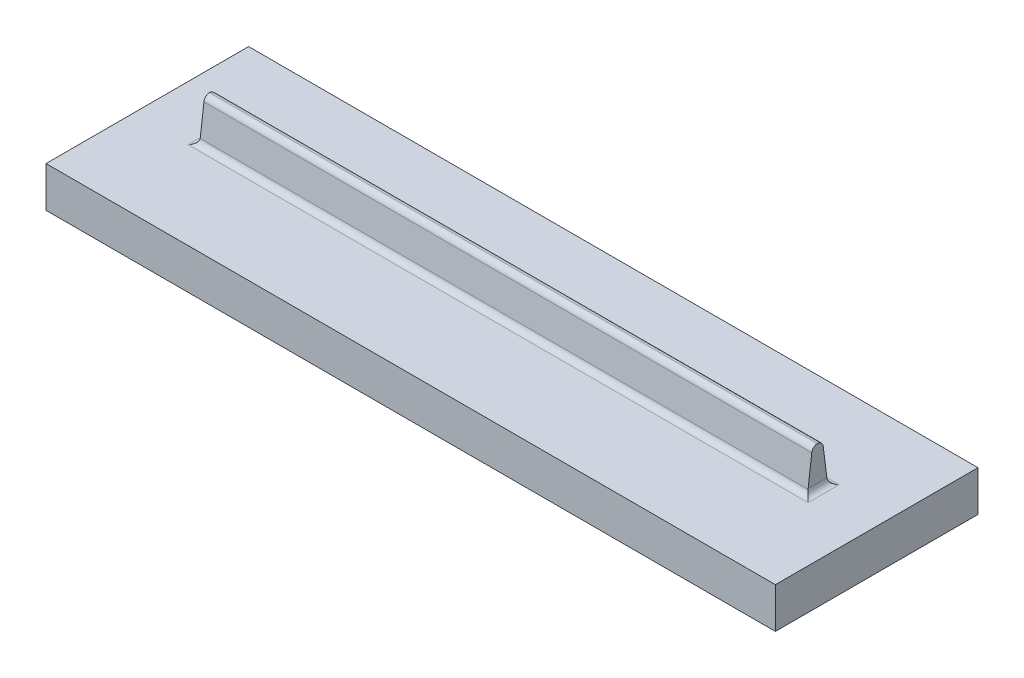
ISO-10303-21;
HEADER;
FILE_DESCRIPTION(('STEP AP214'),'2;1');
FILE_NAME('part.step','',(''),(''),'','','');
FILE_SCHEMA(('AUTOMOTIVE_DESIGN { 1 0 10303 214 1 1 1 1 }'));
ENDSEC;
DATA;
#1=APPLICATION_CONTEXT('core data for automotive mechanical design processes');
#2=APPLICATION_PROTOCOL_DEFINITION('international standard','automotive_design',2000,#1);
#3=PRODUCT_CONTEXT('',#1,'mechanical');
#4=PRODUCT('Part','Part','',(#3));
#5=PRODUCT_RELATED_PRODUCT_CATEGORY('part','',(#4));
#6=PRODUCT_DEFINITION_FORMATION('','',#4);
#7=PRODUCT_DEFINITION_CONTEXT('part definition',#1,'design');
#8=PRODUCT_DEFINITION('design','',#6,#7);
#9=PRODUCT_DEFINITION_SHAPE('','',#8);
#10=(LENGTH_UNIT() NAMED_UNIT(*) SI_UNIT(.MILLI.,.METRE.));
#11=(NAMED_UNIT(*) PLANE_ANGLE_UNIT() SI_UNIT($,.RADIAN.));
#12=(NAMED_UNIT(*) SI_UNIT($,.STERADIAN.) SOLID_ANGLE_UNIT());
#13=UNCERTAINTY_MEASURE_WITH_UNIT(LENGTH_MEASURE(1.E-05),#10,'distance_accuracy_value','');
#14=(GEOMETRIC_REPRESENTATION_CONTEXT(3) GLOBAL_UNCERTAINTY_ASSIGNED_CONTEXT((#13)) GLOBAL_UNIT_ASSIGNED_CONTEXT((#10,
#11,#12)) REPRESENTATION_CONTEXT('',''));
#15=CARTESIAN_POINT('',(0.,0.,0.));
#16=DIRECTION('',(0.,0.,1.));
#17=DIRECTION('',(1.,0.,0.));
#18=AXIS2_PLACEMENT_3D('',#15,#16,#17);
#19=CARTESIAN_POINT('',(-52.624584717608,20.,-0.0536212624584604));
#20=DIRECTION('',(0.,0.124034734589208,0.992277876713668));
#21=DIRECTION('',(0.,-0.992277876713668,0.124034734589208));
#22=AXIS2_PLACEMENT_3D('',#19,#20,#21);
#23=PLANE('',#22);
#24=DIRECTION('',(0.,-0.992277876713668,0.124034734589208));
#25=VECTOR('',#24,1.);
#26=CARTESIAN_POINT('',(-37.624584717608,20.,-0.0536212624584604));
#27=LINE('',#26,#25);
#28=CARTESIAN_POINT('',(-37.624584717608,18.6934985044712,0.109691424482645));
#29=VERTEX_POINT('',#28);
#30=CARTESIAN_POINT('',(-37.624584717608,11.5,1.00887873754154));
#31=VERTEX_POINT('',#30);
#32=EDGE_CURVE('E230',#29,#31,#27,.T.);
#33=ORIENTED_EDGE('',*,*,#32,.T.);
#34=CARTESIAN_POINT('',(-39.124584717608,11.5,1.00887873754154));
#35=DIRECTION('',(0.,0.124034734589208,0.992277876713668));
#36=DIRECTION('',(0.,0.992277876713668,-0.124034734589208));
#37=AXIS2_PLACEMENT_3D('',#34,#35,#36);
#38=ELLIPSE('',#37,1.51167332780598,1.5);
#39=CARTESIAN_POINT('',(-37.6361679025375,11.3139478981162,1.03213525027702));
#40=VERTEX_POINT('',#39);
#41=EDGE_CURVE('E194',#31,#40,#38,.F.);
#42=ORIENTED_EDGE('',*,*,#41,.T.);
#43=DIRECTION('',(1.,0.,0.));
#44=VECTOR('',#43,1.);
#45=CARTESIAN_POINT('',(112.375415282392,11.3139478981162,1.03213525027702));
#46=LINE('',#45,#44);
#47=CARTESIAN_POINT('',(112.386998467322,11.3139478981162,1.03213525027702));
#48=VERTEX_POINT('',#47);
#49=EDGE_CURVE('E53',#40,#48,#46,.T.);
#50=ORIENTED_EDGE('',*,*,#49,.T.);
#51=CARTESIAN_POINT('',(113.875415282392,11.5,1.00887873754154));
#52=DIRECTION('',(0.,0.124034734589208,0.992277876713668));
#53=DIRECTION('',(0.,-0.992277876713668,0.124034734589208));
#54=AXIS2_PLACEMENT_3D('',#51,#52,#53);
#55=ELLIPSE('',#54,1.51167332780598,1.5);
#56=CARTESIAN_POINT('',(112.375415282392,11.5,1.00887873754154));
#57=VERTEX_POINT('',#56);
#58=EDGE_CURVE('E11',#48,#57,#55,.F.);
#59=ORIENTED_EDGE('',*,*,#58,.T.);
#60=DIRECTION('',(0.,0.992277876713668,-0.124034734589208));
#61=VECTOR('',#60,1.);
#62=CARTESIAN_POINT('',(112.375415282392,20.,-0.0536212624584604));
#63=LINE('',#62,#61);
#64=CARTESIAN_POINT('',(112.375415282392,18.6934985044712,0.109691424482645));
#65=VERTEX_POINT('',#64);
#66=EDGE_CURVE('E225',#57,#65,#63,.T.);
#67=ORIENTED_EDGE('',*,*,#66,.T.);
#68=DIRECTION('',(-1.,0.,0.));
#69=VECTOR('',#68,1.);
#70=CARTESIAN_POINT('',(-37.624584717608,18.6934985044712,0.109691424482645));
#71=LINE('',#70,#69);
#72=EDGE_CURVE('E182',#65,#29,#71,.T.);
#73=ORIENTED_EDGE('',*,*,#72,.T.);
#74=EDGE_LOOP('',(#33,#42,#50,#59,#67,#73));
#75=FACE_BOUND('',#74,.T.);
#76=ADVANCED_FACE('F39',(#75),#23,.T.);
#77=CARTESIAN_POINT('',(-52.624584717608,20.,-2.55362126245846));
#78=DIRECTION('',(0.,0.124034734589208,-0.992277876713668));
#79=DIRECTION('',(0.,0.992277876713668,0.124034734589208));
#80=AXIS2_PLACEMENT_3D('',#77,#78,#79);
#81=PLANE('',#80);
#82=DIRECTION('',(0.,-0.992277876713668,-0.124034734589208));
#83=VECTOR('',#82,1.);
#84=CARTESIAN_POINT('',(112.375415282392,20.,-2.55362126245846));
#85=LINE('',#84,#83);
#86=CARTESIAN_POINT('',(112.375415282392,18.6860521018838,-2.71786474972298));
#87=VERTEX_POINT('',#86);
#88=CARTESIAN_POINT('',(112.375415282392,11.5,-3.61612126245846));
#89=VERTEX_POINT('',#88);
#90=EDGE_CURVE('E159',#87,#89,#85,.T.);
#91=ORIENTED_EDGE('',*,*,#90,.T.);
#92=CARTESIAN_POINT('',(113.875415282392,11.5,-3.61612126245846));
#93=DIRECTION('',(0.,0.124034734589208,-0.992277876713668));
#94=DIRECTION('',(0.,0.992277876713668,0.124034734589208));
#95=AXIS2_PLACEMENT_3D('',#92,#93,#94);
#96=ELLIPSE('',#95,1.51167332780598,1.5);
#97=CARTESIAN_POINT('',(112.386998467322,11.3139478981162,-3.63937777519394));
#98=VERTEX_POINT('',#97);
#99=EDGE_CURVE('E213',#89,#98,#96,.F.);
#100=ORIENTED_EDGE('',*,*,#99,.T.);
#101=DIRECTION('',(1.,0.,0.));
#102=VECTOR('',#101,1.);
#103=CARTESIAN_POINT('',(-39.124584717608,11.3139478981162,-3.63937777519394));
#104=LINE('',#103,#102);
#105=CARTESIAN_POINT('',(-37.6361679025375,11.3139478981162,-3.63937777519394));
#106=VERTEX_POINT('',#105);
#107=EDGE_CURVE('E61',#98,#106,#104,.F.);
#108=ORIENTED_EDGE('',*,*,#107,.T.);
#109=CARTESIAN_POINT('',(-39.124584717608,11.5,-3.61612126245846));
#110=DIRECTION('',(0.,0.124034734589208,-0.992277876713668));
#111=DIRECTION('',(0.,-0.992277876713668,-0.124034734589208));
#112=AXIS2_PLACEMENT_3D('',#109,#110,#111);
#113=ELLIPSE('',#112,1.51167332780598,1.5);
#114=CARTESIAN_POINT('',(-37.624584717608,11.5,-3.61612126245846));
#115=VERTEX_POINT('',#114);
#116=EDGE_CURVE('E199',#106,#115,#113,.F.);
#117=ORIENTED_EDGE('',*,*,#116,.T.);
#118=DIRECTION('',(0.,0.992277876713668,0.124034734589208));
#119=VECTOR('',#118,1.);
#120=CARTESIAN_POINT('',(-37.624584717608,20.,-2.55362126245846));
#121=LINE('',#120,#119);
#122=CARTESIAN_POINT('',(-37.624584717608,18.6860521018838,-2.71786474972298));
#123=VERTEX_POINT('',#122);
#124=EDGE_CURVE('E234',#115,#123,#121,.T.);
#125=ORIENTED_EDGE('',*,*,#124,.T.);
#126=DIRECTION('',(1.,0.,0.));
#127=VECTOR('',#126,1.);
#128=CARTESIAN_POINT('',(-52.624584717608,18.6860521018838,-2.71786474972298));
#129=LINE('',#128,#127);
#130=EDGE_CURVE('E162',#123,#87,#129,.T.);
#131=ORIENTED_EDGE('',*,*,#130,.T.);
#132=EDGE_LOOP('',(#91,#100,#108,#117,#125,#131));
#133=FACE_BOUND('',#132,.T.);
#134=ADVANCED_FACE('F266',(#133),#81,.T.);
#135=CARTESIAN_POINT('',(-52.624584717608,10.,-25.9136212624585));
#136=DIRECTION('',(1.,0.,0.));
#137=DIRECTION('',(0.,0.,-1.));
#138=AXIS2_PLACEMENT_3D('',#135,#136,#137);
#139=PLANE('',#138);
#140=DIRECTION('',(0.,-1.,0.));
#141=VECTOR('',#140,1.);
#142=CARTESIAN_POINT('',(-52.624584717608,10.,24.0863787375415));
#143=LINE('',#142,#141);
#144=CARTESIAN_POINT('',(-52.624584717608,10.,24.0863787375415));
#145=VERTEX_POINT('',#144);
#146=CARTESIAN_POINT('',(-52.624584717608,0.,24.0863787375415));
#147=VERTEX_POINT('',#146);
#148=EDGE_CURVE('E149',#145,#147,#143,.T.);
#149=ORIENTED_EDGE('',*,*,#148,.F.);
#150=DIRECTION('',(0.,0.,1.));
#151=VECTOR('',#150,1.);
#152=CARTESIAN_POINT('',(-52.624584717608,10.,-25.9136212624585));
#153=LINE('',#152,#151);
#154=CARTESIAN_POINT('',(-52.624584717608,10.,-25.9136212624585));
#155=VERTEX_POINT('',#154);
#156=EDGE_CURVE('E133',#155,#145,#153,.T.);
#157=ORIENTED_EDGE('',*,*,#156,.F.);
#158=DIRECTION('',(0.,-1.,0.));
#159=VECTOR('',#158,1.);
#160=CARTESIAN_POINT('',(-52.624584717608,10.,-25.9136212624585));
#161=LINE('',#160,#159);
#162=CARTESIAN_POINT('',(-52.624584717608,0.,-25.9136212624585));
#163=VERTEX_POINT('',#162);
#164=EDGE_CURVE('E239',#155,#163,#161,.T.);
#165=ORIENTED_EDGE('',*,*,#164,.T.);
#166=DIRECTION('',(0.,0.,1.));
#167=VECTOR('',#166,1.);
#168=CARTESIAN_POINT('',(-52.624584717608,0.,-25.9136212624585));
#169=LINE('',#168,#167);
#170=EDGE_CURVE('E158',#163,#147,#169,.T.);
#171=ORIENTED_EDGE('',*,*,#170,.T.);
#172=EDGE_LOOP('',(#149,#157,#165,#171));
#173=FACE_BOUND('',#172,.T.);
#174=ADVANCED_FACE('F156',(#173),#139,.F.);
#175=CARTESIAN_POINT('',(-52.624584717608,10.,24.0863787375415));
#176=DIRECTION('',(0.,0.,-1.));
#177=DIRECTION('',(-1.,0.,0.));
#178=AXIS2_PLACEMENT_3D('',#175,#176,#177);
#179=PLANE('',#178);
#180=DIRECTION('',(1.,0.,0.));
#181=VECTOR('',#180,1.);
#182=CARTESIAN_POINT('',(-52.624584717608,0.,24.0863787375415));
#183=LINE('',#182,#181);
#184=CARTESIAN_POINT('',(127.375415282392,0.,24.0863787375415));
#185=VERTEX_POINT('',#184);
#186=EDGE_CURVE('E232',#147,#185,#183,.T.);
#187=ORIENTED_EDGE('',*,*,#186,.T.);
#188=DIRECTION('',(0.,-1.,0.));
#189=VECTOR('',#188,1.);
#190=CARTESIAN_POINT('',(127.375415282392,10.,24.0863787375415));
#191=LINE('',#190,#189);
#192=CARTESIAN_POINT('',(127.375415282392,10.,24.0863787375415));
#193=VERTEX_POINT('',#192);
#194=EDGE_CURVE('E152',#193,#185,#191,.T.);
#195=ORIENTED_EDGE('',*,*,#194,.F.);
#196=DIRECTION('',(1.,0.,0.));
#197=VECTOR('',#196,1.);
#198=CARTESIAN_POINT('',(-52.624584717608,10.,24.0863787375415));
#199=LINE('',#198,#197);
#200=EDGE_CURVE('E136',#145,#193,#199,.T.);
#201=ORIENTED_EDGE('',*,*,#200,.F.);
#202=ORIENTED_EDGE('',*,*,#148,.T.);
#203=EDGE_LOOP('',(#187,#195,#201,#202));
#204=FACE_BOUND('',#203,.T.);
#205=ADVANCED_FACE('F148',(#204),#179,.F.);
#206=CARTESIAN_POINT('',(127.375415282392,10.,-25.9136212624585));
#207=DIRECTION('',(-1.,0.,0.));
#208=DIRECTION('',(0.,0.,1.));
#209=AXIS2_PLACEMENT_3D('',#206,#207,#208);
#210=PLANE('',#209);
#211=DIRECTION('',(0.,-1.,0.));
#212=VECTOR('',#211,1.);
#213=CARTESIAN_POINT('',(127.375415282392,10.,-25.9136212624585));
#214=LINE('',#213,#212);
#215=CARTESIAN_POINT('',(127.375415282392,10.,-25.9136212624585));
#216=VERTEX_POINT('',#215);
#217=CARTESIAN_POINT('',(127.375415282392,0.,-25.9136212624585));
#218=VERTEX_POINT('',#217);
#219=EDGE_CURVE('E164',#216,#218,#214,.T.);
#220=ORIENTED_EDGE('',*,*,#219,.F.);
#221=DIRECTION('',(0.,0.,-1.));
#222=VECTOR('',#221,1.);
#223=CARTESIAN_POINT('',(127.375415282392,10.,-25.9136212624585));
#224=LINE('',#223,#222);
#225=EDGE_CURVE('E154',#193,#216,#224,.T.);
#226=ORIENTED_EDGE('',*,*,#225,.F.);
#227=ORIENTED_EDGE('',*,*,#194,.T.);
#228=DIRECTION('',(0.,0.,-1.));
#229=VECTOR('',#228,1.);
#230=CARTESIAN_POINT('',(127.375415282392,0.,-25.9136212624585));
#231=LINE('',#230,#229);
#232=EDGE_CURVE('E242',#185,#218,#231,.T.);
#233=ORIENTED_EDGE('',*,*,#232,.T.);
#234=EDGE_LOOP('',(#220,#226,#227,#233));
#235=FACE_BOUND('',#234,.T.);
#236=ADVANCED_FACE('F254',(#235),#210,.F.);
#237=CARTESIAN_POINT('',(-52.624584717608,10.,-25.9136212624585));
#238=DIRECTION('',(0.,0.,1.));
#239=DIRECTION('',(1.,0.,0.));
#240=AXIS2_PLACEMENT_3D('',#237,#238,#239);
#241=PLANE('',#240);
#242=DIRECTION('',(-1.,0.,0.));
#243=VECTOR('',#242,1.);
#244=CARTESIAN_POINT('',(-52.624584717608,0.,-25.9136212624585));
#245=LINE('',#244,#243);
#246=EDGE_CURVE('E144',#218,#163,#245,.T.);
#247=ORIENTED_EDGE('',*,*,#246,.T.);
#248=ORIENTED_EDGE('',*,*,#164,.F.);
#249=DIRECTION('',(-1.,0.,0.));
#250=VECTOR('',#249,1.);
#251=CARTESIAN_POINT('',(-52.624584717608,10.,-25.9136212624585));
#252=LINE('',#251,#250);
#253=EDGE_CURVE('E139',#216,#155,#252,.T.);
#254=ORIENTED_EDGE('',*,*,#253,.F.);
#255=ORIENTED_EDGE('',*,*,#219,.T.);
#256=EDGE_LOOP('',(#247,#248,#254,#255));
#257=FACE_BOUND('',#256,.T.);
#258=ADVANCED_FACE('F249',(#257),#241,.F.);
#259=CARTESIAN_POINT('',(0.,10.,0.));
#260=DIRECTION('',(0.,1.,0.));
#261=DIRECTION('',(0.,0.,1.));
#262=AXIS2_PLACEMENT_3D('',#259,#260,#261);
#263=PLANE('',#262);
#264=DIRECTION('',(1.,0.,0.));
#265=VECTOR('',#264,1.);
#266=CARTESIAN_POINT('',(112.375415282392,10.,-5.12779459026444));
#267=LINE('',#266,#265);
#268=CARTESIAN_POINT('',(-39.124584717608,10.,-5.12779459026444));
#269=VERTEX_POINT('',#268);
#270=CARTESIAN_POINT('',(113.875415282392,10.,-5.12779459026444));
#271=VERTEX_POINT('',#270);
#272=EDGE_CURVE('E201',#269,#271,#267,.T.);
#273=ORIENTED_EDGE('',*,*,#272,.T.);
#274=DIRECTION('',(0.,0.,-1.));
#275=VECTOR('',#274,1.);
#276=CARTESIAN_POINT('',(113.875415282392,10.,2.52055206534752));
#277=LINE('',#276,#275);
#278=CARTESIAN_POINT('',(113.875415282392,10.,2.52055206534752));
#279=VERTEX_POINT('',#278);
#280=EDGE_CURVE('E210',#271,#279,#277,.F.);
#281=ORIENTED_EDGE('',*,*,#280,.T.);
#282=DIRECTION('',(1.,0.,0.));
#283=VECTOR('',#282,1.);
#284=CARTESIAN_POINT('',(-37.624584717608,10.,2.52055206534752));
#285=LINE('',#284,#283);
#286=CARTESIAN_POINT('',(-39.124584717608,10.,2.52055206534752));
#287=VERTEX_POINT('',#286);
#288=EDGE_CURVE('E187',#279,#287,#285,.F.);
#289=ORIENTED_EDGE('',*,*,#288,.T.);
#290=DIRECTION('',(0.,0.,1.));
#291=VECTOR('',#290,1.);
#292=CARTESIAN_POINT('',(-39.124584717608,10.,-3.80362126245846));
#293=LINE('',#292,#291);
#294=EDGE_CURVE('E192',#287,#269,#293,.F.);
#295=ORIENTED_EDGE('',*,*,#294,.T.);
#296=EDGE_LOOP('',(#273,#281,#289,#295));
#297=FACE_BOUND('',#296,.T.);
#298=ORIENTED_EDGE('',*,*,#156,.T.);
#299=ORIENTED_EDGE('',*,*,#200,.T.);
#300=ORIENTED_EDGE('',*,*,#225,.T.);
#301=ORIENTED_EDGE('',*,*,#253,.T.);
#302=EDGE_LOOP('',(#298,#299,#300,#301));
#303=FACE_BOUND('',#302,.T.);
#304=ADVANCED_FACE('F135',(#297,#303),#263,.T.);
#305=CARTESIAN_POINT('',(0.,0.,0.));
#306=DIRECTION('',(0.,1.,0.));
#307=DIRECTION('',(0.,0.,1.));
#308=AXIS2_PLACEMENT_3D('',#305,#306,#307);
#309=PLANE('',#308);
#310=ORIENTED_EDGE('',*,*,#170,.F.);
#311=ORIENTED_EDGE('',*,*,#246,.F.);
#312=ORIENTED_EDGE('',*,*,#232,.F.);
#313=ORIENTED_EDGE('',*,*,#186,.F.);
#314=EDGE_LOOP('',(#310,#311,#312,#313));
#315=FACE_BOUND('',#314,.T.);
#316=ADVANCED_FACE('F253',(#315),#309,.F.);
#317=CARTESIAN_POINT('',(112.375415282392,0.,0.));
#318=DIRECTION('',(1.,0.,0.));
#319=DIRECTION('',(0.,0.,-1.));
#320=AXIS2_PLACEMENT_3D('',#317,#318,#319);
#321=PLANE('',#320);
#322=ORIENTED_EDGE('',*,*,#66,.F.);
#323=DIRECTION('',(0.,0.,-1.));
#324=VECTOR('',#323,1.);
#325=CARTESIAN_POINT('',(112.375415282392,11.5,-5.12779459026444));
#326=LINE('',#325,#324);
#327=EDGE_CURVE('E207',#57,#89,#326,.T.);
#328=ORIENTED_EDGE('',*,*,#327,.T.);
#329=ORIENTED_EDGE('',*,*,#90,.F.);
#330=CARTESIAN_POINT('',(112.375415282392,18.5,-1.22944793465248));
#331=DIRECTION('',(1.,0.,0.));
#332=DIRECTION('',(0.,0.,-1.));
#333=AXIS2_PLACEMENT_3D('',#330,#331,#332);
#334=CIRCLE('',#333,1.5);
#335=CARTESIAN_POINT('',(112.375415282392,20.,-1.22944793465248));
#336=VERTEX_POINT('',#335);
#337=EDGE_CURVE('E170',#87,#336,#334,.T.);
#338=ORIENTED_EDGE('',*,*,#337,.T.);
#339=CARTESIAN_POINT('',(112.375415282392,18.5074464025873,-1.37872539058786));
#340=DIRECTION('',(1.,0.,0.));
#341=DIRECTION('',(0.,0.,-1.));
#342=AXIS2_PLACEMENT_3D('',#339,#340,#341);
#343=CIRCLE('',#342,1.5);
#344=EDGE_CURVE('E179',#336,#65,#343,.T.);
#345=ORIENTED_EDGE('',*,*,#344,.T.);
#346=EDGE_LOOP('',(#322,#328,#329,#338,#345));
#347=FACE_BOUND('',#346,.T.);
#348=ADVANCED_FACE('F227',(#347),#321,.T.);
#349=CARTESIAN_POINT('',(-37.624584717608,0.,0.));
#350=DIRECTION('',(-1.,0.,0.));
#351=DIRECTION('',(0.,0.,1.));
#352=AXIS2_PLACEMENT_3D('',#349,#350,#351);
#353=PLANE('',#352);
#354=ORIENTED_EDGE('',*,*,#124,.F.);
#355=DIRECTION('',(0.,0.,1.));
#356=VECTOR('',#355,1.);
#357=CARTESIAN_POINT('',(-37.624584717608,11.5,2.52055206534752));
#358=LINE('',#357,#356);
#359=EDGE_CURVE('E189',#115,#31,#358,.T.);
#360=ORIENTED_EDGE('',*,*,#359,.T.);
#361=ORIENTED_EDGE('',*,*,#32,.F.);
#362=CARTESIAN_POINT('',(-37.624584717608,18.5074464025873,-1.37872539058786));
#363=DIRECTION('',(-1.,0.,0.));
#364=DIRECTION('',(0.,0.,1.));
#365=AXIS2_PLACEMENT_3D('',#362,#363,#364);
#366=CIRCLE('',#365,1.5);
#367=CARTESIAN_POINT('',(-37.624584717608,20.,-1.22944793465248));
#368=VERTEX_POINT('',#367);
#369=EDGE_CURVE('E184',#29,#368,#366,.T.);
#370=ORIENTED_EDGE('',*,*,#369,.T.);
#371=CARTESIAN_POINT('',(-37.624584717608,18.5,-1.22944793465248));
#372=DIRECTION('',(-1.,0.,0.));
#373=DIRECTION('',(0.,0.,1.));
#374=AXIS2_PLACEMENT_3D('',#371,#372,#373);
#375=CIRCLE('',#374,1.5);
#376=EDGE_CURVE('E176',#368,#123,#375,.T.);
#377=ORIENTED_EDGE('',*,*,#376,.T.);
#378=EDGE_LOOP('',(#354,#360,#361,#370,#377));
#379=FACE_BOUND('',#378,.T.);
#380=ADVANCED_FACE('F282',(#379),#353,.T.);
#381=CARTESIAN_POINT('',(-52.624584717608,18.5,-1.22944793465248));
#382=DIRECTION('',(1.,0.,0.));
#383=DIRECTION('',(0.,0.,-1.));
#384=AXIS2_PLACEMENT_3D('',#381,#382,#383);
#385=CYLINDRICAL_SURFACE('',#384,1.5);
#386=ORIENTED_EDGE('',*,*,#376,.F.);
#387=DIRECTION('',(1.,0.,0.));
#388=VECTOR('',#387,1.);
#389=CARTESIAN_POINT('',(-52.624584717608,20.,-1.22944793465248));
#390=LINE('',#389,#388);
#391=EDGE_CURVE('E173',#336,#368,#390,.F.);
#392=ORIENTED_EDGE('',*,*,#391,.F.);
#393=ORIENTED_EDGE('',*,*,#337,.F.);
#394=ORIENTED_EDGE('',*,*,#130,.F.);
#395=EDGE_LOOP('',(#386,#392,#393,#394));
#396=FACE_BOUND('',#395,.T.);
#397=ADVANCED_FACE('F287',(#396),#385,.T.);
#398=CARTESIAN_POINT('',(-52.624584717608,18.5074464025873,-1.37872539058786));
#399=DIRECTION('',(1.,0.,0.));
#400=DIRECTION('',(0.,0.,-1.));
#401=AXIS2_PLACEMENT_3D('',#398,#399,#400);
#402=CYLINDRICAL_SURFACE('',#401,1.5);
#403=ORIENTED_EDGE('',*,*,#369,.F.);
#404=ORIENTED_EDGE('',*,*,#72,.F.);
#405=ORIENTED_EDGE('',*,*,#344,.F.);
#406=ORIENTED_EDGE('',*,*,#391,.T.);
#407=EDGE_LOOP('',(#403,#404,#405,#406));
#408=FACE_BOUND('',#407,.T.);
#409=ADVANCED_FACE('F294',(#408),#402,.T.);
#410=CARTESIAN_POINT('',(-52.624584717608,11.5,2.52055206534752));
#411=DIRECTION('',(-1.,0.,0.));
#412=DIRECTION('',(0.,0.,1.));
#413=AXIS2_PLACEMENT_3D('',#410,#411,#412);
#414=CYLINDRICAL_SURFACE('',#413,1.5);
#415=ORIENTED_EDGE('',*,*,#49,.F.);
#416=CARTESIAN_POINT('',(-39.124584717608,11.5,2.52055206534752));
#417=DIRECTION('',(-0.707106781186548,0.,-0.707106781186547));
#418=DIRECTION('',(-0.707106781186547,0.,0.707106781186548));
#419=AXIS2_PLACEMENT_3D('',#416,#417,#418);
#420=ELLIPSE('',#419,2.12132034355964,1.5);
#421=EDGE_CURVE('E196',#40,#287,#420,.T.);
#422=ORIENTED_EDGE('',*,*,#421,.T.);
#423=ORIENTED_EDGE('',*,*,#288,.F.);
#424=CARTESIAN_POINT('',(113.875415282392,11.5,2.52055206534752));
#425=DIRECTION('',(-0.707106781186547,0.,0.707106781186548));
#426=DIRECTION('',(-0.707106781186547,0.,-0.707106781186548));
#427=AXIS2_PLACEMENT_3D('',#424,#425,#426);
#428=ELLIPSE('',#427,2.12132034355964,1.5);
#429=EDGE_CURVE('E47',#279,#48,#428,.F.);
#430=ORIENTED_EDGE('',*,*,#429,.T.);
#431=EDGE_LOOP('',(#415,#422,#423,#430));
#432=FACE_BOUND('',#431,.T.);
#433=ADVANCED_FACE('F219',(#432),#414,.F.);
#434=CARTESIAN_POINT('',(-39.124584717608,11.5,0.));
#435=DIRECTION('',(0.,0.,-1.));
#436=DIRECTION('',(-1.,0.,0.));
#437=AXIS2_PLACEMENT_3D('',#434,#435,#436);
#438=CYLINDRICAL_SURFACE('',#437,1.5);
#439=ORIENTED_EDGE('',*,*,#116,.F.);
#440=CARTESIAN_POINT('',(-39.124584717608,11.5,-5.12779459026444));
#441=DIRECTION('',(0.707106781186547,0.,-0.707106781186548));
#442=DIRECTION('',(-0.707106781186548,0.,-0.707106781186547));
#443=AXIS2_PLACEMENT_3D('',#440,#441,#442);
#444=ELLIPSE('',#443,2.12132034355964,1.5);
#445=EDGE_CURVE('E204',#106,#269,#444,.T.);
#446=ORIENTED_EDGE('',*,*,#445,.T.);
#447=ORIENTED_EDGE('',*,*,#294,.F.);
#448=ORIENTED_EDGE('',*,*,#421,.F.);
#449=ORIENTED_EDGE('',*,*,#41,.F.);
#450=ORIENTED_EDGE('',*,*,#359,.F.);
#451=EDGE_LOOP('',(#439,#446,#447,#448,#449,#450));
#452=FACE_BOUND('',#451,.T.);
#453=ADVANCED_FACE('F304',(#452),#438,.F.);
#454=CARTESIAN_POINT('',(0.,11.5,-5.12779459026444));
#455=DIRECTION('',(-1.,0.,0.));
#456=DIRECTION('',(0.,0.,1.));
#457=AXIS2_PLACEMENT_3D('',#454,#455,#456);
#458=CYLINDRICAL_SURFACE('',#457,1.5);
#459=ORIENTED_EDGE('',*,*,#445,.F.);
#460=ORIENTED_EDGE('',*,*,#107,.F.);
#461=CARTESIAN_POINT('',(113.875415282392,11.5,-5.12779459026444));
#462=DIRECTION('',(-0.707106781186547,0.,-0.707106781186548));
#463=DIRECTION('',(-0.707106781186547,0.,0.707106781186548));
#464=AXIS2_PLACEMENT_3D('',#461,#462,#463);
#465=ELLIPSE('',#464,2.12132034355964,1.5);
#466=EDGE_CURVE('E215',#98,#271,#465,.F.);
#467=ORIENTED_EDGE('',*,*,#466,.T.);
#468=ORIENTED_EDGE('',*,*,#272,.F.);
#469=EDGE_LOOP('',(#459,#460,#467,#468));
#470=FACE_BOUND('',#469,.T.);
#471=ADVANCED_FACE('F312',(#470),#458,.F.);
#472=CARTESIAN_POINT('',(113.875415282392,11.5,0.));
#473=DIRECTION('',(0.,0.,1.));
#474=DIRECTION('',(1.,0.,0.));
#475=AXIS2_PLACEMENT_3D('',#472,#473,#474);
#476=CYLINDRICAL_SURFACE('',#475,1.5);
#477=ORIENTED_EDGE('',*,*,#429,.F.);
#478=ORIENTED_EDGE('',*,*,#280,.F.);
#479=ORIENTED_EDGE('',*,*,#466,.F.);
#480=ORIENTED_EDGE('',*,*,#99,.F.);
#481=ORIENTED_EDGE('',*,*,#327,.F.);
#482=ORIENTED_EDGE('',*,*,#58,.F.);
#483=EDGE_LOOP('',(#477,#478,#479,#480,#481,#482));
#484=FACE_BOUND('',#483,.T.);
#485=ADVANCED_FACE('F41',(#484),#476,.F.);
#486=CLOSED_SHELL('',(#76,#134,#174,#205,#236,#258,#304,#316,#348,#380,#397,#409,#433,#453,#471,#485));
#487=MANIFOLD_SOLID_BREP('B2',#486);
#488=ADVANCED_BREP_SHAPE_REPRESENTATION('',(#18,#487),#14);
#489=SHAPE_DEFINITION_REPRESENTATION(#9,#488);
ENDSEC;
END-ISO-10303-21;
